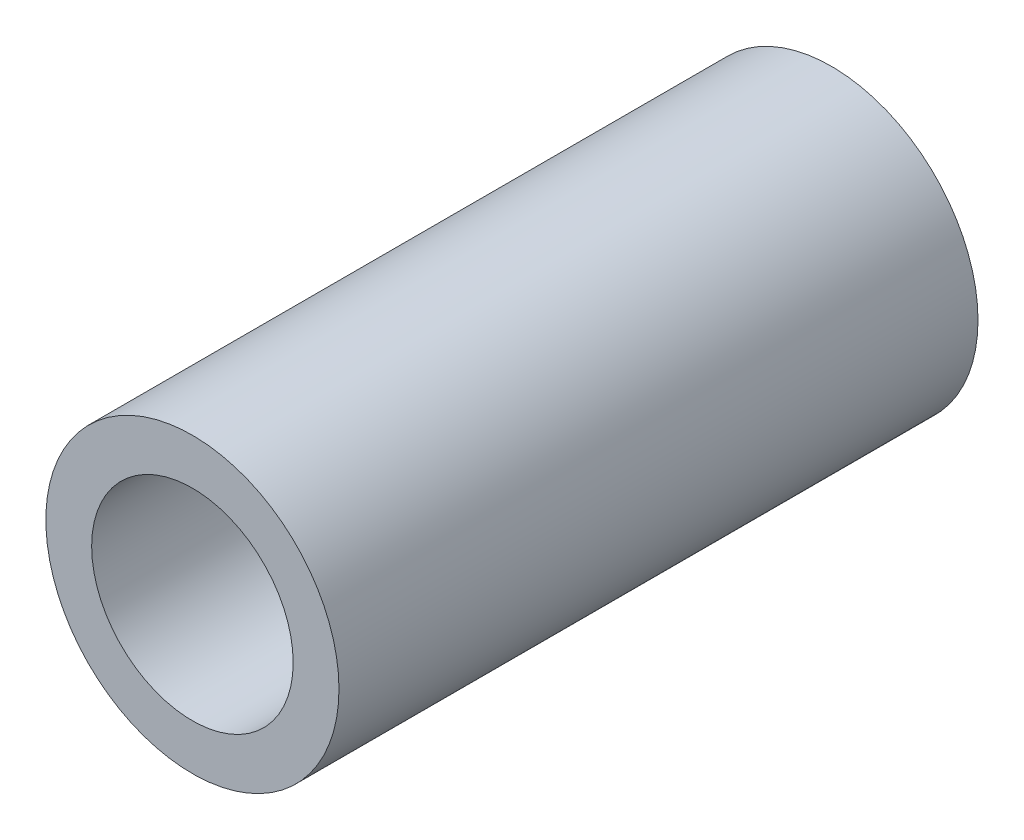
ISO-10303-21;
HEADER;
FILE_DESCRIPTION(('STEP AP214'),'2;1');
FILE_NAME('part.step','',(''),(''),'','','');
FILE_SCHEMA(('AUTOMOTIVE_DESIGN { 1 0 10303 214 1 1 1 1 }'));
ENDSEC;
DATA;
#1=APPLICATION_CONTEXT('core data for automotive mechanical design processes');
#2=APPLICATION_PROTOCOL_DEFINITION('international standard','automotive_design',2000,#1);
#3=PRODUCT_CONTEXT('',#1,'mechanical');
#4=PRODUCT('Part','Part','',(#3));
#5=PRODUCT_RELATED_PRODUCT_CATEGORY('part','',(#4));
#6=PRODUCT_DEFINITION_FORMATION('','',#4);
#7=PRODUCT_DEFINITION_CONTEXT('part definition',#1,'design');
#8=PRODUCT_DEFINITION('design','',#6,#7);
#9=PRODUCT_DEFINITION_SHAPE('','',#8);
#10=(LENGTH_UNIT() NAMED_UNIT(*) SI_UNIT(.MILLI.,.METRE.));
#11=(NAMED_UNIT(*) PLANE_ANGLE_UNIT() SI_UNIT($,.RADIAN.));
#12=(NAMED_UNIT(*) SI_UNIT($,.STERADIAN.) SOLID_ANGLE_UNIT());
#13=UNCERTAINTY_MEASURE_WITH_UNIT(LENGTH_MEASURE(1.E-05),#10,'distance_accuracy_value','');
#14=(GEOMETRIC_REPRESENTATION_CONTEXT(3) GLOBAL_UNCERTAINTY_ASSIGNED_CONTEXT((#13)) GLOBAL_UNIT_ASSIGNED_CONTEXT((#10,
#11,#12)) REPRESENTATION_CONTEXT('',''));
#15=CARTESIAN_POINT('',(0.,0.,0.));
#16=DIRECTION('',(0.,0.,1.));
#17=DIRECTION('',(1.,0.,0.));
#18=AXIS2_PLACEMENT_3D('',#15,#16,#17);
#19=CARTESIAN_POINT('',(0.,0.,17.44));
#20=DIRECTION('',(0.,0.,1.));
#21=DIRECTION('',(1.,0.,0.));
#22=AXIS2_PLACEMENT_3D('',#19,#20,#21);
#23=PLANE('',#22);
#24=CARTESIAN_POINT('',(0.,0.,17.44));
#25=DIRECTION('',(0.,0.,1.));
#26=DIRECTION('',(1.,0.,0.));
#27=AXIS2_PLACEMENT_3D('',#24,#25,#26);
#28=CIRCLE('',#27,4.);
#29=CARTESIAN_POINT('',(4.,0.,17.44));
#30=VERTEX_POINT('',#29);
#31=EDGE_CURVE('E10',#30,#30,#28,.T.);
#32=ORIENTED_EDGE('',*,*,#31,.T.);
#33=EDGE_LOOP('',(#32));
#34=FACE_BOUND('',#33,.T.);
#35=CARTESIAN_POINT('',(0.,0.,17.44));
#36=DIRECTION('',(0.,0.,1.));
#37=DIRECTION('',(1.,0.,0.));
#38=AXIS2_PLACEMENT_3D('',#35,#36,#37);
#39=CIRCLE('',#38,2.75);
#40=CARTESIAN_POINT('',(2.75,0.,17.44));
#41=VERTEX_POINT('',#40);
#42=EDGE_CURVE('E50',#41,#41,#39,.T.);
#43=ORIENTED_EDGE('',*,*,#42,.F.);
#44=EDGE_LOOP('',(#43));
#45=FACE_BOUND('',#44,.T.);
#46=ADVANCED_FACE('F37',(#34,#45),#23,.T.);
#47=CARTESIAN_POINT('',(0.,0.,0.));
#48=DIRECTION('',(0.,0.,1.));
#49=DIRECTION('',(1.,0.,0.));
#50=AXIS2_PLACEMENT_3D('',#47,#48,#49);
#51=PLANE('',#50);
#52=CARTESIAN_POINT('',(0.,0.,0.));
#53=DIRECTION('',(0.,0.,1.));
#54=DIRECTION('',(1.,0.,0.));
#55=AXIS2_PLACEMENT_3D('',#52,#53,#54);
#56=CIRCLE('',#55,4.);
#57=CARTESIAN_POINT('',(4.,0.,0.));
#58=VERTEX_POINT('',#57);
#59=EDGE_CURVE('E41',#58,#58,#56,.T.);
#60=ORIENTED_EDGE('',*,*,#59,.F.);
#61=EDGE_LOOP('',(#60));
#62=FACE_BOUND('',#61,.T.);
#63=CARTESIAN_POINT('',(0.,0.,0.));
#64=DIRECTION('',(0.,0.,1.));
#65=DIRECTION('',(1.,0.,0.));
#66=AXIS2_PLACEMENT_3D('',#63,#64,#65);
#67=CIRCLE('',#66,2.75);
#68=CARTESIAN_POINT('',(2.75,0.,0.));
#69=VERTEX_POINT('',#68);
#70=EDGE_CURVE('E52',#69,#69,#67,.T.);
#71=ORIENTED_EDGE('',*,*,#70,.T.);
#72=EDGE_LOOP('',(#71));
#73=FACE_BOUND('',#72,.T.);
#74=ADVANCED_FACE('F64',(#62,#73),#51,.F.);
#75=CARTESIAN_POINT('',(0.,0.,17.44));
#76=DIRECTION('',(0.,0.,-1.));
#77=DIRECTION('',(-1.,0.,0.));
#78=AXIS2_PLACEMENT_3D('',#75,#76,#77);
#79=CYLINDRICAL_SURFACE('',#78,4.);
#80=ORIENTED_EDGE('',*,*,#31,.F.);
#81=EDGE_LOOP('',(#80));
#82=FACE_BOUND('',#81,.T.);
#83=ORIENTED_EDGE('',*,*,#59,.T.);
#84=EDGE_LOOP('',(#83));
#85=FACE_BOUND('',#84,.T.);
#86=ADVANCED_FACE('F39',(#82,#85),#79,.T.);
#87=CARTESIAN_POINT('',(0.,0.,17.44));
#88=DIRECTION('',(0.,0.,-1.));
#89=DIRECTION('',(-1.,0.,0.));
#90=AXIS2_PLACEMENT_3D('',#87,#88,#89);
#91=CYLINDRICAL_SURFACE('',#90,2.75);
#92=ORIENTED_EDGE('',*,*,#42,.T.);
#93=EDGE_LOOP('',(#92));
#94=FACE_BOUND('',#93,.T.);
#95=ORIENTED_EDGE('',*,*,#70,.F.);
#96=EDGE_LOOP('',(#95));
#97=FACE_BOUND('',#96,.T.);
#98=ADVANCED_FACE('F60',(#94,#97),#91,.F.);
#99=CLOSED_SHELL('',(#46,#74,#86,#98));
#100=MANIFOLD_SOLID_BREP('B2',#99);
#101=ADVANCED_BREP_SHAPE_REPRESENTATION('',(#18,#100),#14);
#102=SHAPE_DEFINITION_REPRESENTATION(#9,#101);
ENDSEC;
END-ISO-10303-21;
